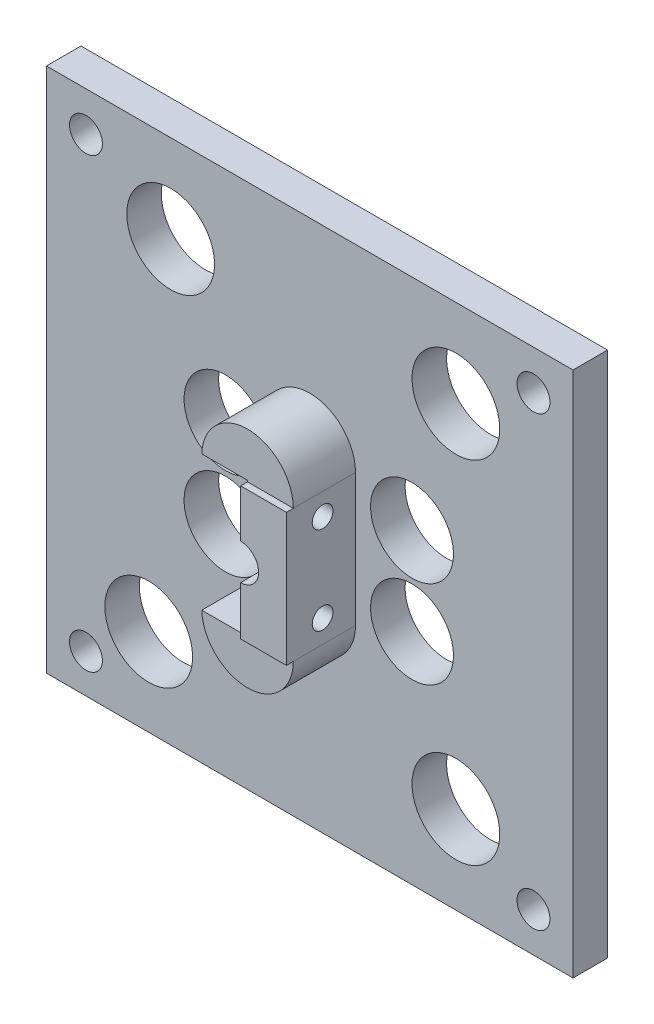
ISO-10303-21;
HEADER;
FILE_DESCRIPTION(('STEP AP214'),'2;1');
FILE_NAME('part.step','',(''),(''),'','','');
FILE_SCHEMA(('AUTOMOTIVE_DESIGN { 1 0 10303 214 1 1 1 1 }'));
ENDSEC;
DATA;
#1=APPLICATION_CONTEXT('core data for automotive mechanical design processes');
#2=APPLICATION_PROTOCOL_DEFINITION('international standard','automotive_design',2000,#1);
#3=PRODUCT_CONTEXT('',#1,'mechanical');
#4=PRODUCT('Part','Part','',(#3));
#5=PRODUCT_RELATED_PRODUCT_CATEGORY('part','',(#4));
#6=PRODUCT_DEFINITION_FORMATION('','',#4);
#7=PRODUCT_DEFINITION_CONTEXT('part definition',#1,'design');
#8=PRODUCT_DEFINITION('design','',#6,#7);
#9=PRODUCT_DEFINITION_SHAPE('','',#8);
#10=(LENGTH_UNIT() NAMED_UNIT(*) SI_UNIT(.MILLI.,.METRE.));
#11=(NAMED_UNIT(*) PLANE_ANGLE_UNIT() SI_UNIT($,.RADIAN.));
#12=(NAMED_UNIT(*) SI_UNIT($,.STERADIAN.) SOLID_ANGLE_UNIT());
#13=UNCERTAINTY_MEASURE_WITH_UNIT(LENGTH_MEASURE(1.E-05),#10,'distance_accuracy_value','');
#14=(GEOMETRIC_REPRESENTATION_CONTEXT(3) GLOBAL_UNCERTAINTY_ASSIGNED_CONTEXT((#13)) GLOBAL_UNIT_ASSIGNED_CONTEXT((#10,
#11,#12)) REPRESENTATION_CONTEXT('',''));
#15=CARTESIAN_POINT('',(0.,0.,0.));
#16=DIRECTION('',(0.,0.,1.));
#17=DIRECTION('',(1.,0.,0.));
#18=AXIS2_PLACEMENT_3D('',#15,#16,#17);
#19=CARTESIAN_POINT('',(-84.65,38.0999999999996,0.));
#20=DIRECTION('',(0.,0.,1.));
#21=DIRECTION('',(1.,0.,0.));
#22=AXIS2_PLACEMENT_3D('',#19,#20,#21);
#23=PLANE('',#22);
#24=CARTESIAN_POINT('',(-46.55,-9.6635978542281,0.));
#25=DIRECTION('',(0.,0.,1.));
#26=DIRECTION('',(-1.,0.,0.));
#27=AXIS2_PLACEMENT_3D('',#24,#25,#26);
#28=CIRCLE('',#27,6.62500000000001);
#29=CARTESIAN_POINT('',(-53.1719804439458,-9.8635978542281,0.));
#30=VERTEX_POINT('',#29);
#31=CARTESIAN_POINT('',(-39.925,-9.6635978542281,0.));
#32=VERTEX_POINT('',#31);
#33=EDGE_CURVE('E187',#30,#32,#28,.T.);
#34=ORIENTED_EDGE('',*,*,#33,.F.);
#35=DIRECTION('',(1.,0.,0.));
#36=VECTOR('',#35,1.);
#37=CARTESIAN_POINT('',(-46.55,-9.8635978542281,0.));
#38=LINE('',#37,#36);
#39=CARTESIAN_POINT('',(-46.55,-9.8635978542281,0.));
#40=VERTEX_POINT('',#39);
#41=EDGE_CURVE('E159',#30,#40,#38,.T.);
#42=ORIENTED_EDGE('',*,*,#41,.T.);
#43=DIRECTION('',(0.,-1.,0.));
#44=VECTOR('',#43,1.);
#45=CARTESIAN_POINT('',(-46.55,-2.60000000000043,0.));
#46=LINE('',#45,#44);
#47=CARTESIAN_POINT('',(-46.55,-2.60000000000085,0.));
#48=VERTEX_POINT('',#47);
#49=EDGE_CURVE('E317',#48,#40,#46,.T.);
#50=ORIENTED_EDGE('',*,*,#49,.F.);
#51=CARTESIAN_POINT('',(-46.55,-4.26952432338381E-13,0.));
#52=DIRECTION('',(0.,0.,-1.));
#53=DIRECTION('',(-1.,0.,0.));
#54=AXIS2_PLACEMENT_3D('',#51,#52,#53);
#55=CIRCLE('',#54,2.60000000000042);
#56=CARTESIAN_POINT('',(-46.55,2.6,0.));
#57=VERTEX_POINT('',#56);
#58=EDGE_CURVE('E149',#48,#57,#55,.T.);
#59=ORIENTED_EDGE('',*,*,#58,.T.);
#60=DIRECTION('',(0.,-1.,0.));
#61=VECTOR('',#60,1.);
#62=CARTESIAN_POINT('',(-46.55,9.525,0.));
#63=LINE('',#62,#61);
#64=CARTESIAN_POINT('',(-46.55,9.725,0.));
#65=VERTEX_POINT('',#64);
#66=EDGE_CURVE('E141',#65,#57,#63,.T.);
#67=ORIENTED_EDGE('',*,*,#66,.F.);
#68=DIRECTION('',(-1.,0.,0.));
#69=VECTOR('',#68,1.);
#70=CARTESIAN_POINT('',(-53.9975781076571,9.725,0.));
#71=LINE('',#70,#69);
#72=CARTESIAN_POINT('',(-53.1719804439458,9.725,0.));
#73=VERTEX_POINT('',#72);
#74=EDGE_CURVE('E145',#65,#73,#71,.T.);
#75=ORIENTED_EDGE('',*,*,#74,.T.);
#76=CARTESIAN_POINT('',(-46.55,9.525,0.));
#77=DIRECTION('',(0.,0.,1.));
#78=DIRECTION('',(1.,0.,0.));
#79=AXIS2_PLACEMENT_3D('',#76,#77,#78);
#80=CIRCLE('',#79,6.62500000000002);
#81=CARTESIAN_POINT('',(-39.925,9.525,0.));
#82=VERTEX_POINT('',#81);
#83=EDGE_CURVE('E178',#82,#73,#80,.T.);
#84=ORIENTED_EDGE('',*,*,#83,.F.);
#85=DIRECTION('',(0.,1.,0.));
#86=VECTOR('',#85,1.);
#87=CARTESIAN_POINT('',(-39.925,-9.6635978542281,0.));
#88=LINE('',#87,#86);
#89=EDGE_CURVE('E153',#32,#82,#88,.T.);
#90=ORIENTED_EDGE('',*,*,#89,.F.);
#91=EDGE_LOOP('',(#34,#42,#50,#59,#67,#75,#84,#90));
#92=FACE_BOUND('',#91,.T.);
#93=CARTESIAN_POINT('',(-58.7375,-6.35,0.));
#94=DIRECTION('',(0.,0.,-1.));
#95=DIRECTION('',(-1.,0.,0.));
#96=AXIS2_PLACEMENT_3D('',#93,#94,#95);
#97=CIRCLE('',#96,6.);
#98=CARTESIAN_POINT('',(-64.7375,-6.35,0.));
#99=VERTEX_POINT('',#98);
#100=EDGE_CURVE('E213',#99,#99,#97,.T.);
#101=ORIENTED_EDGE('',*,*,#100,.T.);
#102=EDGE_LOOP('',(#101));
#103=FACE_BOUND('',#102,.T.);
#104=CARTESIAN_POINT('',(-58.7375,6.35,0.));
#105=DIRECTION('',(0.,0.,-1.));
#106=DIRECTION('',(-1.,0.,0.));
#107=AXIS2_PLACEMENT_3D('',#104,#105,#106);
#108=CIRCLE('',#107,6.);
#109=CARTESIAN_POINT('',(-64.7375,6.35,0.));
#110=VERTEX_POINT('',#109);
#111=EDGE_CURVE('E207',#110,#110,#108,.T.);
#112=ORIENTED_EDGE('',*,*,#111,.T.);
#113=EDGE_LOOP('',(#112));
#114=FACE_BOUND('',#113,.T.);
#115=CARTESIAN_POINT('',(-31.75,6.35,0.));
#116=DIRECTION('',(0.,0.,-1.));
#117=DIRECTION('',(-1.,0.,0.));
#118=AXIS2_PLACEMENT_3D('',#115,#116,#117);
#119=CIRCLE('',#118,6.);
#120=CARTESIAN_POINT('',(-37.75,6.35,0.));
#121=VERTEX_POINT('',#120);
#122=EDGE_CURVE('E197',#121,#121,#119,.T.);
#123=ORIENTED_EDGE('',*,*,#122,.T.);
#124=EDGE_LOOP('',(#123));
#125=FACE_BOUND('',#124,.T.);
#126=CARTESIAN_POINT('',(-25.4,-25.4,0.));
#127=DIRECTION('',(0.,0.,-1.));
#128=DIRECTION('',(-1.,0.,0.));
#129=AXIS2_PLACEMENT_3D('',#126,#127,#128);
#130=CIRCLE('',#129,6.35);
#131=CARTESIAN_POINT('',(-31.75,-25.4,0.));
#132=VERTEX_POINT('',#131);
#133=EDGE_CURVE('E219',#132,#132,#130,.T.);
#134=ORIENTED_EDGE('',*,*,#133,.T.);
#135=EDGE_LOOP('',(#134));
#136=FACE_BOUND('',#135,.T.);
#137=CARTESIAN_POINT('',(-66.675,25.4,0.));
#138=DIRECTION('',(0.,0.,-1.));
#139=DIRECTION('',(-1.,0.,0.));
#140=AXIS2_PLACEMENT_3D('',#137,#138,#139);
#141=CIRCLE('',#140,6.35000000000001);
#142=CARTESIAN_POINT('',(-73.025,25.4,0.));
#143=VERTEX_POINT('',#142);
#144=EDGE_CURVE('E231',#143,#143,#141,.T.);
#145=ORIENTED_EDGE('',*,*,#144,.T.);
#146=EDGE_LOOP('',(#145));
#147=FACE_BOUND('',#146,.T.);
#148=CARTESIAN_POINT('',(-14.17,32.3799999999996,0.));
#149=DIRECTION('',(0.,0.,-1.));
#150=DIRECTION('',(-1.,0.,0.));
#151=AXIS2_PLACEMENT_3D('',#148,#149,#150);
#152=CIRCLE('',#151,2.38125);
#153=CARTESIAN_POINT('',(-16.55125,32.3799999999996,0.));
#154=VERTEX_POINT('',#153);
#155=EDGE_CURVE('E252',#154,#154,#152,.T.);
#156=ORIENTED_EDGE('',*,*,#155,.T.);
#157=EDGE_LOOP('',(#156));
#158=FACE_BOUND('',#157,.T.);
#159=CARTESIAN_POINT('',(-78.93,-32.3800000000004,0.));
#160=DIRECTION('',(0.,0.,-1.));
#161=DIRECTION('',(-1.,0.,0.));
#162=AXIS2_PLACEMENT_3D('',#159,#160,#161);
#163=CIRCLE('',#162,2.38125);
#164=CARTESIAN_POINT('',(-81.31125,-32.3800000000004,0.));
#165=VERTEX_POINT('',#164);
#166=EDGE_CURVE('E264',#165,#165,#163,.T.);
#167=ORIENTED_EDGE('',*,*,#166,.T.);
#168=EDGE_LOOP('',(#167));
#169=FACE_BOUND('',#168,.T.);
#170=DIRECTION('',(0.,1.,0.));
#171=VECTOR('',#170,1.);
#172=CARTESIAN_POINT('',(-84.65,38.0999999999996,0.));
#173=LINE('',#172,#171);
#174=CARTESIAN_POINT('',(-84.65,-37.9953575722425,0.));
#175=VERTEX_POINT('',#174);
#176=CARTESIAN_POINT('',(-84.65,38.0999999999996,0.));
#177=VERTEX_POINT('',#176);
#178=EDGE_CURVE('E270',#175,#177,#173,.T.);
#179=ORIENTED_EDGE('',*,*,#178,.F.);
#180=DIRECTION('',(-0.999999057079536,0.00137325891192217,0.));
#181=VECTOR('',#180,1.);
#182=CARTESIAN_POINT('',(-84.65,-37.9953575722425,0.));
#183=LINE('',#182,#181);
#184=CARTESIAN_POINT('',(-8.45,-38.1000000000004,0.));
#185=VERTEX_POINT('',#184);
#186=EDGE_CURVE('E277',#185,#175,#183,.T.);
#187=ORIENTED_EDGE('',*,*,#186,.F.);
#188=DIRECTION('',(0.,-1.,0.));
#189=VECTOR('',#188,1.);
#190=CARTESIAN_POINT('',(-8.44999999999999,38.0999999999996,0.));
#191=LINE('',#190,#189);
#192=CARTESIAN_POINT('',(-8.44999999999999,38.0999999999996,0.));
#193=VERTEX_POINT('',#192);
#194=EDGE_CURVE('E288',#193,#185,#191,.T.);
#195=ORIENTED_EDGE('',*,*,#194,.F.);
#196=DIRECTION('',(1.,0.,0.));
#197=VECTOR('',#196,1.);
#198=CARTESIAN_POINT('',(-84.65,38.0999999999996,0.));
#199=LINE('',#198,#197);
#200=EDGE_CURVE('E286',#177,#193,#199,.T.);
#201=ORIENTED_EDGE('',*,*,#200,.F.);
#202=EDGE_LOOP('',(#179,#187,#195,#201));
#203=FACE_BOUND('',#202,.T.);
#204=CARTESIAN_POINT('',(-14.17,-32.3800000000004,0.));
#205=DIRECTION('',(0.,0.,-1.));
#206=DIRECTION('',(-1.,0.,0.));
#207=AXIS2_PLACEMENT_3D('',#204,#205,#206);
#208=CIRCLE('',#207,2.38125);
#209=CARTESIAN_POINT('',(-16.55125,-32.3800000000004,0.));
#210=VERTEX_POINT('',#209);
#211=EDGE_CURVE('E258',#210,#210,#208,.T.);
#212=ORIENTED_EDGE('',*,*,#211,.T.);
#213=EDGE_LOOP('',(#212));
#214=FACE_BOUND('',#213,.T.);
#215=CARTESIAN_POINT('',(-78.93,32.3799999999996,0.));
#216=DIRECTION('',(0.,0.,-1.));
#217=DIRECTION('',(-1.,0.,0.));
#218=AXIS2_PLACEMENT_3D('',#215,#216,#217);
#219=CIRCLE('',#218,2.38125);
#220=CARTESIAN_POINT('',(-81.31125,32.3799999999996,0.));
#221=VERTEX_POINT('',#220);
#222=EDGE_CURVE('E248',#221,#221,#219,.T.);
#223=ORIENTED_EDGE('',*,*,#222,.T.);
#224=EDGE_LOOP('',(#223));
#225=FACE_BOUND('',#224,.T.);
#226=CARTESIAN_POINT('',(-69.85,-25.4,0.));
#227=DIRECTION('',(0.,0.,-1.));
#228=DIRECTION('',(-1.,0.,0.));
#229=AXIS2_PLACEMENT_3D('',#226,#227,#228);
#230=CIRCLE('',#229,6.35000000000001);
#231=CARTESIAN_POINT('',(-76.2,-25.4,0.));
#232=VERTEX_POINT('',#231);
#233=EDGE_CURVE('E237',#232,#232,#230,.T.);
#234=ORIENTED_EDGE('',*,*,#233,.T.);
#235=EDGE_LOOP('',(#234));
#236=FACE_BOUND('',#235,.T.);
#237=CARTESIAN_POINT('',(-25.4,25.4,0.));
#238=DIRECTION('',(0.,0.,-1.));
#239=DIRECTION('',(-1.,0.,0.));
#240=AXIS2_PLACEMENT_3D('',#237,#238,#239);
#241=CIRCLE('',#240,6.35);
#242=CARTESIAN_POINT('',(-31.75,25.4,0.));
#243=VERTEX_POINT('',#242);
#244=EDGE_CURVE('E225',#243,#243,#241,.T.);
#245=ORIENTED_EDGE('',*,*,#244,.T.);
#246=EDGE_LOOP('',(#245));
#247=FACE_BOUND('',#246,.T.);
#248=CARTESIAN_POINT('',(-31.75,-6.35,0.));
#249=DIRECTION('',(0.,0.,-1.));
#250=DIRECTION('',(-1.,0.,0.));
#251=AXIS2_PLACEMENT_3D('',#248,#249,#250);
#252=CIRCLE('',#251,6.);
#253=CARTESIAN_POINT('',(-37.75,-6.35,0.));
#254=VERTEX_POINT('',#253);
#255=EDGE_CURVE('E201',#254,#254,#252,.T.);
#256=ORIENTED_EDGE('',*,*,#255,.T.);
#257=EDGE_LOOP('',(#256));
#258=FACE_BOUND('',#257,.T.);
#259=ADVANCED_FACE('F33',(#92,#103,#114,#125,#136,#147,#158,#169,#203,#214,#225,#236,#247,#258),
#23,.T.);
#260=CARTESIAN_POINT('',(-46.55,-9.6635978542281,10.));
#261=DIRECTION('',(0.,1.,0.));
#262=DIRECTION('',(0.,0.,1.));
#263=AXIS2_PLACEMENT_3D('',#260,#261,#262);
#264=PLANE('',#263);
#265=DIRECTION('',(-1.,0.,0.));
#266=VECTOR('',#265,1.);
#267=CARTESIAN_POINT('',(-53.175,-9.6635978542281,9.));
#268=LINE('',#267,#266);
#269=CARTESIAN_POINT('',(-39.925,-9.6635978542281,9.));
#270=VERTEX_POINT('',#269);
#271=CARTESIAN_POINT('',(-46.55,-9.6635978542281,9.));
#272=VERTEX_POINT('',#271);
#273=EDGE_CURVE('E190',#270,#272,#268,.T.);
#274=ORIENTED_EDGE('',*,*,#273,.F.);
#275=DIRECTION('',(0.,0.,-1.));
#276=VECTOR('',#275,1.);
#277=CARTESIAN_POINT('',(-39.925,-9.6635978542281,10.));
#278=LINE('',#277,#276);
#279=CARTESIAN_POINT('',(-39.925,-9.6635978542281,10.));
#280=VERTEX_POINT('',#279);
#281=EDGE_CURVE('E348',#280,#270,#278,.T.);
#282=ORIENTED_EDGE('',*,*,#281,.F.);
#283=DIRECTION('',(1.,0.,0.));
#284=VECTOR('',#283,1.);
#285=CARTESIAN_POINT('',(-46.55,-9.6635978542281,10.));
#286=LINE('',#285,#284);
#287=CARTESIAN_POINT('',(-46.55,-9.6635978542281,10.));
#288=VERTEX_POINT('',#287);
#289=EDGE_CURVE('E322',#288,#280,#286,.T.);
#290=ORIENTED_EDGE('',*,*,#289,.F.);
#291=DIRECTION('',(0.,0.,-1.));
#292=VECTOR('',#291,1.);
#293=CARTESIAN_POINT('',(-46.55,-9.6635978542281,10.));
#294=LINE('',#293,#292);
#295=EDGE_CURVE('E354',#288,#272,#294,.T.);
#296=ORIENTED_EDGE('',*,*,#295,.T.);
#297=EDGE_LOOP('',(#274,#282,#290,#296));
#298=FACE_BOUND('',#297,.T.);
#299=ADVANCED_FACE('F368',(#298),#264,.F.);
#300=CARTESIAN_POINT('',(-46.55,-4.26952432338381E-13,10.));
#301=DIRECTION('',(0.,0.,-1.));
#302=DIRECTION('',(-1.,0.,0.));
#303=AXIS2_PLACEMENT_3D('',#300,#301,#302);
#304=CYLINDRICAL_SURFACE('',#303,2.60000000000043);
#305=DIRECTION('',(0.,0.,-1.));
#306=VECTOR('',#305,1.);
#307=CARTESIAN_POINT('',(-46.55,2.60000000000042,10.));
#308=LINE('',#307,#306);
#309=CARTESIAN_POINT('',(-46.55,2.60000000000042,10.));
#310=VERTEX_POINT('',#309);
#311=EDGE_CURVE('E330',#310,#57,#308,.T.);
#312=ORIENTED_EDGE('',*,*,#311,.T.);
#313=ORIENTED_EDGE('',*,*,#58,.F.);
#314=DIRECTION('',(0.,0.,-1.));
#315=VECTOR('',#314,1.);
#316=CARTESIAN_POINT('',(-46.55,-2.60000000000043,10.));
#317=LINE('',#316,#315);
#318=CARTESIAN_POINT('',(-46.55,-2.60000000000043,10.));
#319=VERTEX_POINT('',#318);
#320=EDGE_CURVE('E41',#319,#48,#317,.T.);
#321=ORIENTED_EDGE('',*,*,#320,.F.);
#322=CARTESIAN_POINT('',(-46.55,-4.26952432338381E-13,10.));
#323=DIRECTION('',(0.,0.,-1.));
#324=DIRECTION('',(-1.,0.,0.));
#325=AXIS2_PLACEMENT_3D('',#322,#323,#324);
#326=CIRCLE('',#325,2.60000000000043);
#327=EDGE_CURVE('E152',#310,#319,#326,.T.);
#328=ORIENTED_EDGE('',*,*,#327,.F.);
#329=EDGE_LOOP('',(#312,#313,#321,#328));
#330=FACE_BOUND('',#329,.T.);
#331=CARTESIAN_POINT('',(-46.55,-4.26952432338381E-13,-5.));
#332=DIRECTION('',(0.,0.,-1.));
#333=DIRECTION('',(-1.,0.,0.));
#334=AXIS2_PLACEMENT_3D('',#331,#332,#333);
#335=CIRCLE('',#334,2.60000000000042);
#336=CARTESIAN_POINT('',(-49.1500000000004,-4.26952432338381E-13,-5.));
#337=VERTEX_POINT('',#336);
#338=EDGE_CURVE('E245',#337,#337,#335,.T.);
#339=ORIENTED_EDGE('',*,*,#338,.T.);
#340=EDGE_LOOP('',(#339));
#341=FACE_BOUND('',#340,.T.);
#342=ADVANCED_FACE('F35',(#330,#341),#304,.F.);
#343=CARTESIAN_POINT('',(-46.55,-2.60000000000043,10.));
#344=DIRECTION('',(1.,0.,0.));
#345=DIRECTION('',(0.,0.,-1.));
#346=AXIS2_PLACEMENT_3D('',#343,#344,#345);
#347=PLANE('',#346);
#348=CARTESIAN_POINT('',(-46.55,-6.34999999999998,4.7625));
#349=DIRECTION('',(1.,0.,0.));
#350=DIRECTION('',(0.,0.,-1.));
#351=AXIS2_PLACEMENT_3D('',#348,#349,#350);
#352=CIRCLE('',#351,1.5);
#353=CARTESIAN_POINT('',(-46.55,-6.34999999999998,3.2625));
#354=VERTEX_POINT('',#353);
#355=EDGE_CURVE('E308',#354,#354,#352,.F.);
#356=ORIENTED_EDGE('',*,*,#355,.F.);
#357=EDGE_LOOP('',(#356));
#358=FACE_BOUND('',#357,.T.);
#359=ORIENTED_EDGE('',*,*,#49,.T.);
#360=DIRECTION('',(0.,0.,1.));
#361=VECTOR('',#360,1.);
#362=CARTESIAN_POINT('',(-46.55,-9.8635978542281,0.));
#363=LINE('',#362,#361);
#364=CARTESIAN_POINT('',(-46.55,-9.8635978542281,9.));
#365=VERTEX_POINT('',#364);
#366=EDGE_CURVE('E158',#40,#365,#363,.T.);
#367=ORIENTED_EDGE('',*,*,#366,.T.);
#368=DIRECTION('',(0.,1.,0.));
#369=VECTOR('',#368,1.);
#370=CARTESIAN_POINT('',(-46.55,-9.6635978542281,9.));
#371=LINE('',#370,#369);
#372=EDGE_CURVE('E164',#365,#272,#371,.T.);
#373=ORIENTED_EDGE('',*,*,#372,.T.);
#374=ORIENTED_EDGE('',*,*,#295,.F.);
#375=DIRECTION('',(0.,-1.,0.));
#376=VECTOR('',#375,1.);
#377=CARTESIAN_POINT('',(-46.55,-2.60000000000043,10.));
#378=LINE('',#377,#376);
#379=EDGE_CURVE('E320',#319,#288,#378,.T.);
#380=ORIENTED_EDGE('',*,*,#379,.F.);
#381=ORIENTED_EDGE('',*,*,#320,.T.);
#382=EDGE_LOOP('',(#359,#367,#373,#374,#380,#381));
#383=FACE_BOUND('',#382,.T.);
#384=ADVANCED_FACE('F363',(#358,#383),#347,.F.);
#385=CARTESIAN_POINT('',(-39.925,-9.6635978542281,10.));
#386=DIRECTION('',(-1.,0.,0.));
#387=DIRECTION('',(0.,-1.,0.));
#388=AXIS2_PLACEMENT_3D('',#385,#386,#387);
#389=PLANE('',#388);
#390=CARTESIAN_POINT('',(-39.925,-6.34999999999999,4.7625));
#391=DIRECTION('',(1.,0.,0.));
#392=DIRECTION('',(0.,1.,0.));
#393=AXIS2_PLACEMENT_3D('',#390,#391,#392);
#394=CIRCLE('',#393,1.5);
#395=CARTESIAN_POINT('',(-39.925,-4.84999999999998,4.7625));
#396=VERTEX_POINT('',#395);
#397=EDGE_CURVE('E302',#396,#396,#394,.T.);
#398=ORIENTED_EDGE('',*,*,#397,.F.);
#399=EDGE_LOOP('',(#398));
#400=FACE_BOUND('',#399,.T.);
#401=CARTESIAN_POINT('',(-39.925,6.35000000000001,4.7625));
#402=DIRECTION('',(1.,0.,0.));
#403=DIRECTION('',(0.,1.,0.));
#404=AXIS2_PLACEMENT_3D('',#401,#402,#403);
#405=CIRCLE('',#404,1.5);
#406=CARTESIAN_POINT('',(-39.925,7.85000000000001,4.7625));
#407=VERTEX_POINT('',#406);
#408=EDGE_CURVE('E311',#407,#407,#405,.T.);
#409=ORIENTED_EDGE('',*,*,#408,.F.);
#410=EDGE_LOOP('',(#409));
#411=FACE_BOUND('',#410,.T.);
#412=ORIENTED_EDGE('',*,*,#89,.T.);
#413=DIRECTION('',(0.,0.,-1.));
#414=VECTOR('',#413,1.);
#415=CARTESIAN_POINT('',(-39.925,9.525,9.));
#416=LINE('',#415,#414);
#417=CARTESIAN_POINT('',(-39.925,9.525,9.));
#418=VERTEX_POINT('',#417);
#419=EDGE_CURVE('E184',#418,#82,#416,.T.);
#420=ORIENTED_EDGE('',*,*,#419,.F.);
#421=DIRECTION('',(0.,0.,-1.));
#422=VECTOR('',#421,1.);
#423=CARTESIAN_POINT('',(-39.925,9.525,10.));
#424=LINE('',#423,#422);
#425=CARTESIAN_POINT('',(-39.925,9.525,10.));
#426=VERTEX_POINT('',#425);
#427=EDGE_CURVE('E344',#426,#418,#424,.T.);
#428=ORIENTED_EDGE('',*,*,#427,.F.);
#429=DIRECTION('',(0.,1.,0.));
#430=VECTOR('',#429,1.);
#431=CARTESIAN_POINT('',(-39.925,-9.6635978542281,10.));
#432=LINE('',#431,#430);
#433=EDGE_CURVE('E324',#280,#426,#432,.T.);
#434=ORIENTED_EDGE('',*,*,#433,.F.);
#435=ORIENTED_EDGE('',*,*,#281,.T.);
#436=DIRECTION('',(0.,0.,-1.));
#437=VECTOR('',#436,1.);
#438=CARTESIAN_POINT('',(-39.925,-9.6635978542281,9.));
#439=LINE('',#438,#437);
#440=EDGE_CURVE('E193',#270,#32,#439,.T.);
#441=ORIENTED_EDGE('',*,*,#440,.T.);
#442=EDGE_LOOP('',(#412,#420,#428,#434,#435,#441));
#443=FACE_BOUND('',#442,.T.);
#444=ADVANCED_FACE('F497',(#400,#411,#443),#389,.F.);
#445=CARTESIAN_POINT('',(-46.55,9.525,10.));
#446=DIRECTION('',(0.,-1.,0.));
#447=DIRECTION('',(0.,0.,-1.));
#448=AXIS2_PLACEMENT_3D('',#445,#446,#447);
#449=PLANE('',#448);
#450=ORIENTED_EDGE('',*,*,#427,.T.);
#451=DIRECTION('',(1.,0.,0.));
#452=VECTOR('',#451,1.);
#453=CARTESIAN_POINT('',(-39.925,9.525,9.));
#454=LINE('',#453,#452);
#455=CARTESIAN_POINT('',(-46.55,9.525,9.));
#456=VERTEX_POINT('',#455);
#457=EDGE_CURVE('E182',#456,#418,#454,.T.);
#458=ORIENTED_EDGE('',*,*,#457,.F.);
#459=DIRECTION('',(0.,0.,-1.));
#460=VECTOR('',#459,1.);
#461=CARTESIAN_POINT('',(-46.55,9.525,10.));
#462=LINE('',#461,#460);
#463=CARTESIAN_POINT('',(-46.55,9.525,10.));
#464=VERTEX_POINT('',#463);
#465=EDGE_CURVE('E335',#464,#456,#462,.T.);
#466=ORIENTED_EDGE('',*,*,#465,.F.);
#467=DIRECTION('',(-1.,0.,0.));
#468=VECTOR('',#467,1.);
#469=CARTESIAN_POINT('',(-46.55,9.525,10.));
#470=LINE('',#469,#468);
#471=EDGE_CURVE('E326',#426,#464,#470,.T.);
#472=ORIENTED_EDGE('',*,*,#471,.F.);
#473=EDGE_LOOP('',(#450,#458,#466,#472));
#474=FACE_BOUND('',#473,.T.);
#475=ADVANCED_FACE('F493',(#474),#449,.F.);
#476=CARTESIAN_POINT('',(-46.55,9.525,10.));
#477=DIRECTION('',(1.,0.,0.));
#478=DIRECTION('',(0.,0.,-1.));
#479=AXIS2_PLACEMENT_3D('',#476,#477,#478);
#480=PLANE('',#479);
#481=CARTESIAN_POINT('',(-46.55,6.35000000000002,4.7625));
#482=DIRECTION('',(1.,0.,0.));
#483=DIRECTION('',(0.,0.,-1.));
#484=AXIS2_PLACEMENT_3D('',#481,#482,#483);
#485=CIRCLE('',#484,1.5);
#486=CARTESIAN_POINT('',(-46.55,6.35000000000002,3.2625));
#487=VERTEX_POINT('',#486);
#488=EDGE_CURVE('E314',#487,#487,#485,.F.);
#489=ORIENTED_EDGE('',*,*,#488,.F.);
#490=EDGE_LOOP('',(#489));
#491=FACE_BOUND('',#490,.T.);
#492=ORIENTED_EDGE('',*,*,#66,.T.);
#493=ORIENTED_EDGE('',*,*,#311,.F.);
#494=DIRECTION('',(0.,-1.,0.));
#495=VECTOR('',#494,1.);
#496=CARTESIAN_POINT('',(-46.55,9.525,10.));
#497=LINE('',#496,#495);
#498=EDGE_CURVE('E328',#464,#310,#497,.T.);
#499=ORIENTED_EDGE('',*,*,#498,.F.);
#500=ORIENTED_EDGE('',*,*,#465,.T.);
#501=DIRECTION('',(0.,1.,0.));
#502=VECTOR('',#501,1.);
#503=CARTESIAN_POINT('',(-46.55,9.525,9.));
#504=LINE('',#503,#502);
#505=CARTESIAN_POINT('',(-46.55,9.725,9.));
#506=VERTEX_POINT('',#505);
#507=EDGE_CURVE('E11',#456,#506,#504,.T.);
#508=ORIENTED_EDGE('',*,*,#507,.T.);
#509=DIRECTION('',(0.,0.,1.));
#510=VECTOR('',#509,1.);
#511=CARTESIAN_POINT('',(-46.55,9.725,0.));
#512=LINE('',#511,#510);
#513=EDGE_CURVE('E56',#65,#506,#512,.T.);
#514=ORIENTED_EDGE('',*,*,#513,.F.);
#515=EDGE_LOOP('',(#492,#493,#499,#500,#508,#514));
#516=FACE_BOUND('',#515,.T.);
#517=ADVANCED_FACE('F155',(#491,#516),#480,.F.);
#518=CARTESIAN_POINT('',(-46.55,-4.26952432338381E-13,10.));
#519=DIRECTION('',(0.,0.,-1.));
#520=DIRECTION('',(-1.,0.,0.));
#521=AXIS2_PLACEMENT_3D('',#518,#519,#520);
#522=PLANE('',#521);
#523=ORIENTED_EDGE('',*,*,#327,.T.);
#524=ORIENTED_EDGE('',*,*,#379,.T.);
#525=ORIENTED_EDGE('',*,*,#289,.T.);
#526=ORIENTED_EDGE('',*,*,#433,.T.);
#527=ORIENTED_EDGE('',*,*,#471,.T.);
#528=ORIENTED_EDGE('',*,*,#498,.T.);
#529=EDGE_LOOP('',(#523,#524,#525,#526,#527,#528));
#530=FACE_BOUND('',#529,.T.);
#531=ADVANCED_FACE('F486',(#530),#522,.F.);
#532=CARTESIAN_POINT('',(-50.7926406871193,6.35000000000002,4.7625));
#533=DIRECTION('',(1.,0.,0.));
#534=DIRECTION('',(0.,1.,0.));
#535=AXIS2_PLACEMENT_3D('',#532,#533,#534);
#536=CYLINDRICAL_SURFACE('',#535,1.5);
#537=ORIENTED_EDGE('',*,*,#488,.T.);
#538=EDGE_LOOP('',(#537));
#539=FACE_BOUND('',#538,.T.);
#540=ORIENTED_EDGE('',*,*,#408,.T.);
#541=EDGE_LOOP('',(#540));
#542=FACE_BOUND('',#541,.T.);
#543=ADVANCED_FACE('F482',(#539,#542),#536,.F.);
#544=CARTESIAN_POINT('',(-50.7926406871193,-6.34999999999998,4.7625));
#545=DIRECTION('',(1.,0.,0.));
#546=DIRECTION('',(0.,1.,0.));
#547=AXIS2_PLACEMENT_3D('',#544,#545,#546);
#548=CYLINDRICAL_SURFACE('',#547,1.5);
#549=ORIENTED_EDGE('',*,*,#355,.T.);
#550=EDGE_LOOP('',(#549));
#551=FACE_BOUND('',#550,.T.);
#552=ORIENTED_EDGE('',*,*,#397,.T.);
#553=EDGE_LOOP('',(#552));
#554=FACE_BOUND('',#553,.T.);
#555=ADVANCED_FACE('F375',(#551,#554),#548,.F.);
#556=CARTESIAN_POINT('',(-84.65,38.0999999999996,-5.));
#557=DIRECTION('',(0.,0.,1.));
#558=DIRECTION('',(1.,0.,0.));
#559=AXIS2_PLACEMENT_3D('',#556,#557,#558);
#560=PLANE('',#559);
#561=CARTESIAN_POINT('',(-31.75,-6.35,-5.));
#562=DIRECTION('',(0.,0.,-1.));
#563=DIRECTION('',(-1.,0.,0.));
#564=AXIS2_PLACEMENT_3D('',#561,#562,#563);
#565=CIRCLE('',#564,6.);
#566=CARTESIAN_POINT('',(-37.75,-6.35,-5.));
#567=VERTEX_POINT('',#566);
#568=EDGE_CURVE('E204',#567,#567,#565,.T.);
#569=ORIENTED_EDGE('',*,*,#568,.F.);
#570=EDGE_LOOP('',(#569));
#571=FACE_BOUND('',#570,.T.);
#572=CARTESIAN_POINT('',(-58.7375,-6.35,-5.));
#573=DIRECTION('',(0.,0.,-1.));
#574=DIRECTION('',(-1.,0.,0.));
#575=AXIS2_PLACEMENT_3D('',#572,#573,#574);
#576=CIRCLE('',#575,6.);
#577=CARTESIAN_POINT('',(-64.7375,-6.35,-5.));
#578=VERTEX_POINT('',#577);
#579=EDGE_CURVE('E216',#578,#578,#576,.T.);
#580=ORIENTED_EDGE('',*,*,#579,.F.);
#581=EDGE_LOOP('',(#580));
#582=FACE_BOUND('',#581,.T.);
#583=CARTESIAN_POINT('',(-25.4,25.4,-5.));
#584=DIRECTION('',(0.,0.,-1.));
#585=DIRECTION('',(-1.,0.,0.));
#586=AXIS2_PLACEMENT_3D('',#583,#584,#585);
#587=CIRCLE('',#586,6.35);
#588=CARTESIAN_POINT('',(-31.75,25.4,-5.));
#589=VERTEX_POINT('',#588);
#590=EDGE_CURVE('E228',#589,#589,#587,.T.);
#591=ORIENTED_EDGE('',*,*,#590,.F.);
#592=EDGE_LOOP('',(#591));
#593=FACE_BOUND('',#592,.T.);
#594=CARTESIAN_POINT('',(-69.85,-25.4,-5.));
#595=DIRECTION('',(0.,0.,-1.));
#596=DIRECTION('',(-1.,0.,0.));
#597=AXIS2_PLACEMENT_3D('',#594,#595,#596);
#598=CIRCLE('',#597,6.35000000000001);
#599=CARTESIAN_POINT('',(-76.2,-25.4,-5.));
#600=VERTEX_POINT('',#599);
#601=EDGE_CURVE('E240',#600,#600,#598,.T.);
#602=ORIENTED_EDGE('',*,*,#601,.F.);
#603=EDGE_LOOP('',(#602));
#604=FACE_BOUND('',#603,.T.);
#605=CARTESIAN_POINT('',(-78.93,32.3799999999996,-5.));
#606=DIRECTION('',(0.,0.,-1.));
#607=DIRECTION('',(-1.,0.,0.));
#608=AXIS2_PLACEMENT_3D('',#605,#606,#607);
#609=CIRCLE('',#608,2.38125);
#610=CARTESIAN_POINT('',(-81.31125,32.3799999999996,-5.));
#611=VERTEX_POINT('',#610);
#612=EDGE_CURVE('E249',#611,#611,#609,.T.);
#613=ORIENTED_EDGE('',*,*,#612,.F.);
#614=EDGE_LOOP('',(#613));
#615=FACE_BOUND('',#614,.T.);
#616=CARTESIAN_POINT('',(-14.17,-32.3800000000004,-5.));
#617=DIRECTION('',(0.,0.,-1.));
#618=DIRECTION('',(-1.,0.,0.));
#619=AXIS2_PLACEMENT_3D('',#616,#617,#618);
#620=CIRCLE('',#619,2.38125);
#621=CARTESIAN_POINT('',(-16.55125,-32.3800000000004,-5.));
#622=VERTEX_POINT('',#621);
#623=EDGE_CURVE('E261',#622,#622,#620,.T.);
#624=ORIENTED_EDGE('',*,*,#623,.F.);
#625=EDGE_LOOP('',(#624));
#626=FACE_BOUND('',#625,.T.);
#627=DIRECTION('',(0.,1.,0.));
#628=VECTOR('',#627,1.);
#629=CARTESIAN_POINT('',(-84.65,38.0999999999996,-5.));
#630=LINE('',#629,#628);
#631=CARTESIAN_POINT('',(-84.65,-37.9953575722425,-5.));
#632=VERTEX_POINT('',#631);
#633=CARTESIAN_POINT('',(-84.65,38.0999999999996,-5.));
#634=VERTEX_POINT('',#633);
#635=EDGE_CURVE('E273',#632,#634,#630,.T.);
#636=ORIENTED_EDGE('',*,*,#635,.T.);
#637=DIRECTION('',(1.,0.,0.));
#638=VECTOR('',#637,1.);
#639=CARTESIAN_POINT('',(-84.65,38.0999999999996,-5.));
#640=LINE('',#639,#638);
#641=CARTESIAN_POINT('',(-8.44999999999999,38.0999999999996,-5.));
#642=VERTEX_POINT('',#641);
#643=EDGE_CURVE('E276',#634,#642,#640,.T.);
#644=ORIENTED_EDGE('',*,*,#643,.T.);
#645=DIRECTION('',(0.,-1.,0.));
#646=VECTOR('',#645,1.);
#647=CARTESIAN_POINT('',(-8.44999999999999,38.0999999999996,-5.));
#648=LINE('',#647,#646);
#649=CARTESIAN_POINT('',(-8.45,-38.1000000000004,-5.));
#650=VERTEX_POINT('',#649);
#651=EDGE_CURVE('E279',#642,#650,#648,.T.);
#652=ORIENTED_EDGE('',*,*,#651,.T.);
#653=DIRECTION('',(-0.999999057079536,0.00137325891192217,0.));
#654=VECTOR('',#653,1.);
#655=CARTESIAN_POINT('',(-84.65,-37.9953575722425,-5.));
#656=LINE('',#655,#654);
#657=EDGE_CURVE('E281',#650,#632,#656,.T.);
#658=ORIENTED_EDGE('',*,*,#657,.T.);
#659=EDGE_LOOP('',(#636,#644,#652,#658));
#660=FACE_BOUND('',#659,.T.);
#661=CARTESIAN_POINT('',(-78.93,-32.3800000000004,-5.));
#662=DIRECTION('',(0.,0.,-1.));
#663=DIRECTION('',(-1.,0.,0.));
#664=AXIS2_PLACEMENT_3D('',#661,#662,#663);
#665=CIRCLE('',#664,2.38125);
#666=CARTESIAN_POINT('',(-81.31125,-32.3800000000004,-5.));
#667=VERTEX_POINT('',#666);
#668=EDGE_CURVE('E267',#667,#667,#665,.T.);
#669=ORIENTED_EDGE('',*,*,#668,.F.);
#670=EDGE_LOOP('',(#669));
#671=FACE_BOUND('',#670,.T.);
#672=CARTESIAN_POINT('',(-14.17,32.3799999999996,-5.));
#673=DIRECTION('',(0.,0.,-1.));
#674=DIRECTION('',(-1.,0.,0.));
#675=AXIS2_PLACEMENT_3D('',#672,#673,#674);
#676=CIRCLE('',#675,2.38125);
#677=CARTESIAN_POINT('',(-16.55125,32.3799999999996,-5.));
#678=VERTEX_POINT('',#677);
#679=EDGE_CURVE('E255',#678,#678,#676,.T.);
#680=ORIENTED_EDGE('',*,*,#679,.F.);
#681=EDGE_LOOP('',(#680));
#682=FACE_BOUND('',#681,.T.);
#683=ORIENTED_EDGE('',*,*,#338,.F.);
#684=EDGE_LOOP('',(#683));
#685=FACE_BOUND('',#684,.T.);
#686=CARTESIAN_POINT('',(-66.675,25.4,-5.));
#687=DIRECTION('',(0.,0.,-1.));
#688=DIRECTION('',(-1.,0.,0.));
#689=AXIS2_PLACEMENT_3D('',#686,#687,#688);
#690=CIRCLE('',#689,6.35000000000001);
#691=CARTESIAN_POINT('',(-73.025,25.4,-5.));
#692=VERTEX_POINT('',#691);
#693=EDGE_CURVE('E234',#692,#692,#690,.T.);
#694=ORIENTED_EDGE('',*,*,#693,.F.);
#695=EDGE_LOOP('',(#694));
#696=FACE_BOUND('',#695,.T.);
#697=CARTESIAN_POINT('',(-25.4,-25.4,-5.));
#698=DIRECTION('',(0.,0.,-1.));
#699=DIRECTION('',(-1.,0.,0.));
#700=AXIS2_PLACEMENT_3D('',#697,#698,#699);
#701=CIRCLE('',#700,6.35);
#702=CARTESIAN_POINT('',(-31.75,-25.4,-5.));
#703=VERTEX_POINT('',#702);
#704=EDGE_CURVE('E222',#703,#703,#701,.T.);
#705=ORIENTED_EDGE('',*,*,#704,.F.);
#706=EDGE_LOOP('',(#705));
#707=FACE_BOUND('',#706,.T.);
#708=CARTESIAN_POINT('',(-58.7375,6.35,-5.));
#709=DIRECTION('',(0.,0.,-1.));
#710=DIRECTION('',(-1.,0.,0.));
#711=AXIS2_PLACEMENT_3D('',#708,#709,#710);
#712=CIRCLE('',#711,6.);
#713=CARTESIAN_POINT('',(-64.7375,6.35,-5.));
#714=VERTEX_POINT('',#713);
#715=EDGE_CURVE('E210',#714,#714,#712,.T.);
#716=ORIENTED_EDGE('',*,*,#715,.F.);
#717=EDGE_LOOP('',(#716));
#718=FACE_BOUND('',#717,.T.);
#719=CARTESIAN_POINT('',(-31.75,6.35,-5.));
#720=DIRECTION('',(0.,0.,-1.));
#721=DIRECTION('',(-1.,0.,0.));
#722=AXIS2_PLACEMENT_3D('',#719,#720,#721);
#723=CIRCLE('',#722,6.);
#724=CARTESIAN_POINT('',(-37.75,6.35,-5.));
#725=VERTEX_POINT('',#724);
#726=EDGE_CURVE('E198',#725,#725,#723,.T.);
#727=ORIENTED_EDGE('',*,*,#726,.F.);
#728=EDGE_LOOP('',(#727));
#729=FACE_BOUND('',#728,.T.);
#730=ADVANCED_FACE('F371',(#571,#582,#593,#604,#615,#626,#660,#671,#682,#685,#696,#707,#718,
#729),#560,.F.);
#731=CARTESIAN_POINT('',(-84.65,38.0999999999996,-5.));
#732=DIRECTION('',(1.,0.,0.));
#733=DIRECTION('',(0.,1.,0.));
#734=AXIS2_PLACEMENT_3D('',#731,#732,#733);
#735=PLANE('',#734);
#736=ORIENTED_EDGE('',*,*,#178,.T.);
#737=DIRECTION('',(0.,0.,1.));
#738=VECTOR('',#737,1.);
#739=CARTESIAN_POINT('',(-84.65,38.0999999999996,-5.));
#740=LINE('',#739,#738);
#741=EDGE_CURVE('E299',#634,#177,#740,.T.);
#742=ORIENTED_EDGE('',*,*,#741,.F.);
#743=ORIENTED_EDGE('',*,*,#635,.F.);
#744=DIRECTION('',(0.,0.,1.));
#745=VECTOR('',#744,1.);
#746=CARTESIAN_POINT('',(-84.65,-37.9953575722425,-5.));
#747=LINE('',#746,#745);
#748=EDGE_CURVE('E283',#632,#175,#747,.T.);
#749=ORIENTED_EDGE('',*,*,#748,.T.);
#750=EDGE_LOOP('',(#736,#742,#743,#749));
#751=FACE_BOUND('',#750,.T.);
#752=ADVANCED_FACE('F374',(#751),#735,.F.);
#753=CARTESIAN_POINT('',(-84.65,38.0999999999996,-5.));
#754=DIRECTION('',(0.,-1.,0.));
#755=DIRECTION('',(1.,0.,0.));
#756=AXIS2_PLACEMENT_3D('',#753,#754,#755);
#757=PLANE('',#756);
#758=ORIENTED_EDGE('',*,*,#200,.T.);
#759=DIRECTION('',(0.,0.,1.));
#760=VECTOR('',#759,1.);
#761=CARTESIAN_POINT('',(-8.44999999999999,38.0999999999996,-5.));
#762=LINE('',#761,#760);
#763=EDGE_CURVE('E296',#642,#193,#762,.T.);
#764=ORIENTED_EDGE('',*,*,#763,.F.);
#765=ORIENTED_EDGE('',*,*,#643,.F.);
#766=ORIENTED_EDGE('',*,*,#741,.T.);
#767=EDGE_LOOP('',(#758,#764,#765,#766));
#768=FACE_BOUND('',#767,.T.);
#769=ADVANCED_FACE('F472',(#768),#757,.F.);
#770=CARTESIAN_POINT('',(-8.44999999999999,38.0999999999996,-5.));
#771=DIRECTION('',(-1.,0.,0.));
#772=DIRECTION('',(0.,-1.,0.));
#773=AXIS2_PLACEMENT_3D('',#770,#771,#772);
#774=PLANE('',#773);
#775=ORIENTED_EDGE('',*,*,#194,.T.);
#776=DIRECTION('',(0.,0.,1.));
#777=VECTOR('',#776,1.);
#778=CARTESIAN_POINT('',(-8.45,-38.1000000000004,-5.));
#779=LINE('',#778,#777);
#780=EDGE_CURVE('E293',#650,#185,#779,.T.);
#781=ORIENTED_EDGE('',*,*,#780,.F.);
#782=ORIENTED_EDGE('',*,*,#651,.F.);
#783=ORIENTED_EDGE('',*,*,#763,.T.);
#784=EDGE_LOOP('',(#775,#781,#782,#783));
#785=FACE_BOUND('',#784,.T.);
#786=ADVANCED_FACE('F468',(#785),#774,.F.);
#787=CARTESIAN_POINT('',(-84.65,-37.9953575722425,-5.));
#788=DIRECTION('',(0.00137325891192217,0.999999057079536,0.));
#789=DIRECTION('',(-0.999999057079536,0.00137325891192217,0.));
#790=AXIS2_PLACEMENT_3D('',#787,#788,#789);
#791=PLANE('',#790);
#792=ORIENTED_EDGE('',*,*,#186,.T.);
#793=ORIENTED_EDGE('',*,*,#748,.F.);
#794=ORIENTED_EDGE('',*,*,#657,.F.);
#795=ORIENTED_EDGE('',*,*,#780,.T.);
#796=EDGE_LOOP('',(#792,#793,#794,#795));
#797=FACE_BOUND('',#796,.T.);
#798=ADVANCED_FACE('F463',(#797),#791,.F.);
#799=CARTESIAN_POINT('',(-78.93,-32.3800000000004,-5.));
#800=DIRECTION('',(0.,0.,1.));
#801=DIRECTION('',(1.,0.,0.));
#802=AXIS2_PLACEMENT_3D('',#799,#800,#801);
#803=CYLINDRICAL_SURFACE('',#802,2.38125);
#804=ORIENTED_EDGE('',*,*,#668,.T.);
#805=EDGE_LOOP('',(#804));
#806=FACE_BOUND('',#805,.T.);
#807=ORIENTED_EDGE('',*,*,#166,.F.);
#808=EDGE_LOOP('',(#807));
#809=FACE_BOUND('',#808,.T.);
#810=ADVANCED_FACE('F460',(#806,#809),#803,.F.);
#811=CARTESIAN_POINT('',(-14.17,-32.3800000000004,-5.));
#812=DIRECTION('',(0.,0.,1.));
#813=DIRECTION('',(1.,0.,0.));
#814=AXIS2_PLACEMENT_3D('',#811,#812,#813);
#815=CYLINDRICAL_SURFACE('',#814,2.38125);
#816=ORIENTED_EDGE('',*,*,#623,.T.);
#817=EDGE_LOOP('',(#816));
#818=FACE_BOUND('',#817,.T.);
#819=ORIENTED_EDGE('',*,*,#211,.F.);
#820=EDGE_LOOP('',(#819));
#821=FACE_BOUND('',#820,.T.);
#822=ADVANCED_FACE('F456',(#818,#821),#815,.F.);
#823=CARTESIAN_POINT('',(-14.17,32.3799999999996,-5.));
#824=DIRECTION('',(0.,0.,1.));
#825=DIRECTION('',(1.,0.,0.));
#826=AXIS2_PLACEMENT_3D('',#823,#824,#825);
#827=CYLINDRICAL_SURFACE('',#826,2.38125);
#828=ORIENTED_EDGE('',*,*,#679,.T.);
#829=EDGE_LOOP('',(#828));
#830=FACE_BOUND('',#829,.T.);
#831=ORIENTED_EDGE('',*,*,#155,.F.);
#832=EDGE_LOOP('',(#831));
#833=FACE_BOUND('',#832,.T.);
#834=ADVANCED_FACE('F452',(#830,#833),#827,.F.);
#835=CARTESIAN_POINT('',(-78.93,32.3799999999996,-5.));
#836=DIRECTION('',(0.,0.,1.));
#837=DIRECTION('',(1.,0.,0.));
#838=AXIS2_PLACEMENT_3D('',#835,#836,#837);
#839=CYLINDRICAL_SURFACE('',#838,2.38125);
#840=ORIENTED_EDGE('',*,*,#612,.T.);
#841=EDGE_LOOP('',(#840));
#842=FACE_BOUND('',#841,.T.);
#843=ORIENTED_EDGE('',*,*,#222,.F.);
#844=EDGE_LOOP('',(#843));
#845=FACE_BOUND('',#844,.T.);
#846=ADVANCED_FACE('F448',(#842,#845),#839,.F.);
#847=CARTESIAN_POINT('',(-69.85,-25.4,-5.));
#848=DIRECTION('',(0.,0.,1.));
#849=DIRECTION('',(1.,0.,0.));
#850=AXIS2_PLACEMENT_3D('',#847,#848,#849);
#851=CYLINDRICAL_SURFACE('',#850,6.35000000000001);
#852=ORIENTED_EDGE('',*,*,#601,.T.);
#853=EDGE_LOOP('',(#852));
#854=FACE_BOUND('',#853,.T.);
#855=ORIENTED_EDGE('',*,*,#233,.F.);
#856=EDGE_LOOP('',(#855));
#857=FACE_BOUND('',#856,.T.);
#858=ADVANCED_FACE('F444',(#854,#857),#851,.F.);
#859=CARTESIAN_POINT('',(-66.675,25.4,-5.));
#860=DIRECTION('',(0.,0.,1.));
#861=DIRECTION('',(1.,0.,0.));
#862=AXIS2_PLACEMENT_3D('',#859,#860,#861);
#863=CYLINDRICAL_SURFACE('',#862,6.35000000000001);
#864=ORIENTED_EDGE('',*,*,#693,.T.);
#865=EDGE_LOOP('',(#864));
#866=FACE_BOUND('',#865,.T.);
#867=ORIENTED_EDGE('',*,*,#144,.F.);
#868=EDGE_LOOP('',(#867));
#869=FACE_BOUND('',#868,.T.);
#870=ADVANCED_FACE('F440',(#866,#869),#863,.F.);
#871=CARTESIAN_POINT('',(-25.4,25.4,-5.));
#872=DIRECTION('',(0.,0.,1.));
#873=DIRECTION('',(1.,0.,0.));
#874=AXIS2_PLACEMENT_3D('',#871,#872,#873);
#875=CYLINDRICAL_SURFACE('',#874,6.35);
#876=ORIENTED_EDGE('',*,*,#590,.T.);
#877=EDGE_LOOP('',(#876));
#878=FACE_BOUND('',#877,.T.);
#879=ORIENTED_EDGE('',*,*,#244,.F.);
#880=EDGE_LOOP('',(#879));
#881=FACE_BOUND('',#880,.T.);
#882=ADVANCED_FACE('F436',(#878,#881),#875,.F.);
#883=CARTESIAN_POINT('',(-25.4,-25.4,-5.));
#884=DIRECTION('',(0.,0.,1.));
#885=DIRECTION('',(1.,0.,0.));
#886=AXIS2_PLACEMENT_3D('',#883,#884,#885);
#887=CYLINDRICAL_SURFACE('',#886,6.35);
#888=ORIENTED_EDGE('',*,*,#704,.T.);
#889=EDGE_LOOP('',(#888));
#890=FACE_BOUND('',#889,.T.);
#891=ORIENTED_EDGE('',*,*,#133,.F.);
#892=EDGE_LOOP('',(#891));
#893=FACE_BOUND('',#892,.T.);
#894=ADVANCED_FACE('F432',(#890,#893),#887,.F.);
#895=CARTESIAN_POINT('',(-58.7375,-6.35,-5.));
#896=DIRECTION('',(0.,0.,1.));
#897=DIRECTION('',(1.,0.,0.));
#898=AXIS2_PLACEMENT_3D('',#895,#896,#897);
#899=CYLINDRICAL_SURFACE('',#898,6.);
#900=ORIENTED_EDGE('',*,*,#579,.T.);
#901=EDGE_LOOP('',(#900));
#902=FACE_BOUND('',#901,.T.);
#903=ORIENTED_EDGE('',*,*,#100,.F.);
#904=EDGE_LOOP('',(#903));
#905=FACE_BOUND('',#904,.T.);
#906=ADVANCED_FACE('F425',(#902,#905),#899,.F.);
#907=CARTESIAN_POINT('',(-58.7375,6.35,-5.));
#908=DIRECTION('',(0.,0.,1.));
#909=DIRECTION('',(1.,0.,0.));
#910=AXIS2_PLACEMENT_3D('',#907,#908,#909);
#911=CYLINDRICAL_SURFACE('',#910,6.);
#912=ORIENTED_EDGE('',*,*,#715,.T.);
#913=EDGE_LOOP('',(#912));
#914=FACE_BOUND('',#913,.T.);
#915=ORIENTED_EDGE('',*,*,#111,.F.);
#916=EDGE_LOOP('',(#915));
#917=FACE_BOUND('',#916,.T.);
#918=ADVANCED_FACE('F419',(#914,#917),#911,.F.);
#919=CARTESIAN_POINT('',(-31.75,-6.35,-5.));
#920=DIRECTION('',(0.,0.,1.));
#921=DIRECTION('',(1.,0.,0.));
#922=AXIS2_PLACEMENT_3D('',#919,#920,#921);
#923=CYLINDRICAL_SURFACE('',#922,6.);
#924=ORIENTED_EDGE('',*,*,#568,.T.);
#925=EDGE_LOOP('',(#924));
#926=FACE_BOUND('',#925,.T.);
#927=ORIENTED_EDGE('',*,*,#255,.F.);
#928=EDGE_LOOP('',(#927));
#929=FACE_BOUND('',#928,.T.);
#930=ADVANCED_FACE('F390',(#926,#929),#923,.F.);
#931=CARTESIAN_POINT('',(-31.75,6.35,-5.));
#932=DIRECTION('',(0.,0.,1.));
#933=DIRECTION('',(1.,0.,0.));
#934=AXIS2_PLACEMENT_3D('',#931,#932,#933);
#935=CYLINDRICAL_SURFACE('',#934,6.);
#936=ORIENTED_EDGE('',*,*,#726,.T.);
#937=EDGE_LOOP('',(#936));
#938=FACE_BOUND('',#937,.T.);
#939=ORIENTED_EDGE('',*,*,#122,.F.);
#940=EDGE_LOOP('',(#939));
#941=FACE_BOUND('',#940,.T.);
#942=ADVANCED_FACE('F386',(#938,#941),#935,.F.);
#943=CARTESIAN_POINT('',(-46.55,-9.6635978542281,9.));
#944=DIRECTION('',(0.,0.,-1.));
#945=DIRECTION('',(-1.,0.,0.));
#946=AXIS2_PLACEMENT_3D('',#943,#944,#945);
#947=CYLINDRICAL_SURFACE('',#946,6.62500000000001);
#948=CARTESIAN_POINT('',(-46.55,-9.6635978542281,9.));
#949=DIRECTION('',(0.,0.,1.));
#950=DIRECTION('',(-1.,0.,0.));
#951=AXIS2_PLACEMENT_3D('',#948,#949,#950);
#952=CIRCLE('',#951,6.62500000000001);
#953=CARTESIAN_POINT('',(-53.1719804439458,-9.8635978542281,9.));
#954=VERTEX_POINT('',#953);
#955=EDGE_CURVE('E188',#954,#270,#952,.T.);
#956=ORIENTED_EDGE('',*,*,#955,.F.);
#957=DIRECTION('',(0.,0.,-1.));
#958=VECTOR('',#957,1.);
#959=CARTESIAN_POINT('',(-53.1719804439458,-9.8635978542281,9.));
#960=LINE('',#959,#958);
#961=EDGE_CURVE('E48',#954,#30,#960,.T.);
#962=ORIENTED_EDGE('',*,*,#961,.T.);
#963=ORIENTED_EDGE('',*,*,#33,.T.);
#964=ORIENTED_EDGE('',*,*,#440,.F.);
#965=EDGE_LOOP('',(#956,#962,#963,#964));
#966=FACE_BOUND('',#965,.T.);
#967=ADVANCED_FACE('F389',(#966),#947,.T.);
#968=CARTESIAN_POINT('',(-46.55,-9.6635978542281,9.));
#969=DIRECTION('',(0.,0.,-1.));
#970=DIRECTION('',(-1.,0.,0.));
#971=AXIS2_PLACEMENT_3D('',#968,#969,#970);
#972=PLANE('',#971);
#973=ORIENTED_EDGE('',*,*,#273,.T.);
#974=ORIENTED_EDGE('',*,*,#372,.F.);
#975=DIRECTION('',(1.,0.,0.));
#976=VECTOR('',#975,1.);
#977=CARTESIAN_POINT('',(-46.55,-9.8635978542281,9.));
#978=LINE('',#977,#976);
#979=EDGE_CURVE('E168',#954,#365,#978,.T.);
#980=ORIENTED_EDGE('',*,*,#979,.F.);
#981=ORIENTED_EDGE('',*,*,#955,.T.);
#982=EDGE_LOOP('',(#973,#974,#980,#981));
#983=FACE_BOUND('',#982,.T.);
#984=ADVANCED_FACE('F527',(#983),#972,.F.);
#985=CARTESIAN_POINT('',(-46.55,9.525,9.));
#986=DIRECTION('',(0.,0.,-1.));
#987=DIRECTION('',(-1.,0.,0.));
#988=AXIS2_PLACEMENT_3D('',#985,#986,#987);
#989=CYLINDRICAL_SURFACE('',#988,6.62500000000002);
#990=ORIENTED_EDGE('',*,*,#83,.T.);
#991=DIRECTION('',(0.,0.,-1.));
#992=VECTOR('',#991,1.);
#993=CARTESIAN_POINT('',(-53.1719804439458,9.725,9.));
#994=LINE('',#993,#992);
#995=CARTESIAN_POINT('',(-53.1719804439458,9.725,9.));
#996=VERTEX_POINT('',#995);
#997=EDGE_CURVE('E163',#73,#996,#994,.F.);
#998=ORIENTED_EDGE('',*,*,#997,.T.);
#999=CARTESIAN_POINT('',(-46.55,9.525,9.));
#1000=DIRECTION('',(0.,0.,1.));
#1001=DIRECTION('',(1.,0.,0.));
#1002=AXIS2_PLACEMENT_3D('',#999,#1000,#1001);
#1003=CIRCLE('',#1002,6.62500000000002);
#1004=EDGE_CURVE('E179',#418,#996,#1003,.T.);
#1005=ORIENTED_EDGE('',*,*,#1004,.F.);
#1006=ORIENTED_EDGE('',*,*,#419,.T.);
#1007=EDGE_LOOP('',(#990,#998,#1005,#1006));
#1008=FACE_BOUND('',#1007,.T.);
#1009=ADVANCED_FACE('F517',(#1008),#989,.T.);
#1010=CARTESIAN_POINT('',(-46.55,9.525,9.));
#1011=DIRECTION('',(0.,0.,1.));
#1012=DIRECTION('',(1.,0.,0.));
#1013=AXIS2_PLACEMENT_3D('',#1010,#1011,#1012);
#1014=PLANE('',#1013);
#1015=ORIENTED_EDGE('',*,*,#507,.F.);
#1016=ORIENTED_EDGE('',*,*,#457,.T.);
#1017=ORIENTED_EDGE('',*,*,#1004,.T.);
#1018=DIRECTION('',(-1.,0.,0.));
#1019=VECTOR('',#1018,1.);
#1020=CARTESIAN_POINT('',(-53.9975781076571,9.725,9.));
#1021=LINE('',#1020,#1019);
#1022=EDGE_CURVE('E171',#506,#996,#1021,.T.);
#1023=ORIENTED_EDGE('',*,*,#1022,.F.);
#1024=EDGE_LOOP('',(#1015,#1016,#1017,#1023));
#1025=FACE_BOUND('',#1024,.T.);
#1026=ADVANCED_FACE('F520',(#1025),#1014,.T.);
#1027=CARTESIAN_POINT('',(-53.9975781076571,9.725,0.));
#1028=DIRECTION('',(0.,1.,0.));
#1029=DIRECTION('',(0.,0.,1.));
#1030=AXIS2_PLACEMENT_3D('',#1027,#1028,#1029);
#1031=PLANE('',#1030);
#1032=ORIENTED_EDGE('',*,*,#74,.F.);
#1033=ORIENTED_EDGE('',*,*,#513,.T.);
#1034=ORIENTED_EDGE('',*,*,#1022,.T.);
#1035=ORIENTED_EDGE('',*,*,#997,.F.);
#1036=EDGE_LOOP('',(#1032,#1033,#1034,#1035));
#1037=FACE_BOUND('',#1036,.T.);
#1038=ADVANCED_FACE('F161',(#1037),#1031,.F.);
#1039=CARTESIAN_POINT('',(-46.55,-9.8635978542281,0.));
#1040=DIRECTION('',(0.,-1.,0.));
#1041=DIRECTION('',(0.,0.,-1.));
#1042=AXIS2_PLACEMENT_3D('',#1039,#1040,#1041);
#1043=PLANE('',#1042);
#1044=ORIENTED_EDGE('',*,*,#979,.T.);
#1045=ORIENTED_EDGE('',*,*,#366,.F.);
#1046=ORIENTED_EDGE('',*,*,#41,.F.);
#1047=ORIENTED_EDGE('',*,*,#961,.F.);
#1048=EDGE_LOOP('',(#1044,#1045,#1046,#1047));
#1049=FACE_BOUND('',#1048,.T.);
#1050=ADVANCED_FACE('F542',(#1049),#1043,.F.);
#1051=CLOSED_SHELL('',(#259,#299,#342,#384,#444,#475,#517,#531,#543,#555,#730,#752,#769,#786,
#798,#810,#822,#834,#846,#858,#870,#882,#894,#906,#918,#930,#942,#967,#984,#1009,#1026,#1038,#1050));
#1052=MANIFOLD_SOLID_BREP('B2',#1051);
#1053=ADVANCED_BREP_SHAPE_REPRESENTATION('',(#18,#1052),#14);
#1054=SHAPE_DEFINITION_REPRESENTATION(#9,#1053);
ENDSEC;
END-ISO-10303-21;
